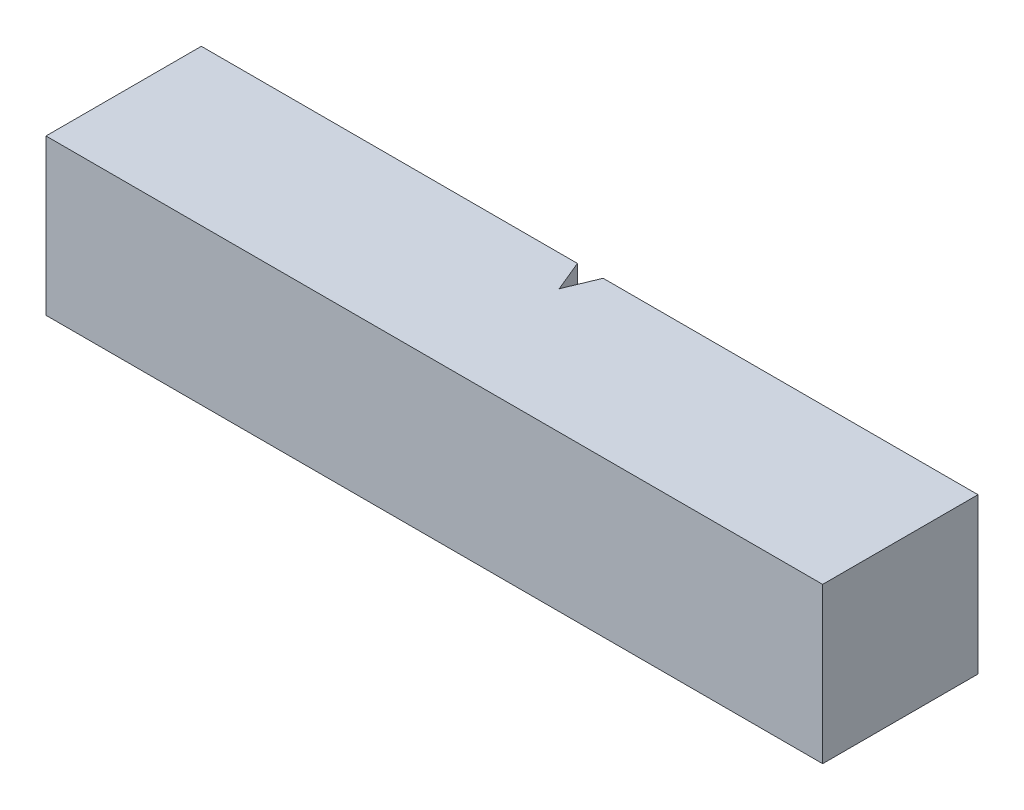
ISO-10303-21;
HEADER;
FILE_DESCRIPTION(('STEP AP214'),'2;1');
FILE_NAME('part.step','',(''),(''),'','','');
FILE_SCHEMA(('AUTOMOTIVE_DESIGN { 1 0 10303 214 1 1 1 1 }'));
ENDSEC;
DATA;
#1=APPLICATION_CONTEXT('core data for automotive mechanical design processes');
#2=APPLICATION_PROTOCOL_DEFINITION('international standard','automotive_design',2000,#1);
#3=PRODUCT_CONTEXT('',#1,'mechanical');
#4=PRODUCT('Part','Part','',(#3));
#5=PRODUCT_RELATED_PRODUCT_CATEGORY('part','',(#4));
#6=PRODUCT_DEFINITION_FORMATION('','',#4);
#7=PRODUCT_DEFINITION_CONTEXT('part definition',#1,'design');
#8=PRODUCT_DEFINITION('design','',#6,#7);
#9=PRODUCT_DEFINITION_SHAPE('','',#8);
#10=(LENGTH_UNIT() NAMED_UNIT(*) SI_UNIT(.MILLI.,.METRE.));
#11=(NAMED_UNIT(*) PLANE_ANGLE_UNIT() SI_UNIT($,.RADIAN.));
#12=(NAMED_UNIT(*) SI_UNIT($,.STERADIAN.) SOLID_ANGLE_UNIT());
#13=UNCERTAINTY_MEASURE_WITH_UNIT(LENGTH_MEASURE(1.E-05),#10,'distance_accuracy_value','');
#14=(GEOMETRIC_REPRESENTATION_CONTEXT(3) GLOBAL_UNCERTAINTY_ASSIGNED_CONTEXT((#13)) GLOBAL_UNIT_ASSIGNED_CONTEXT((#10,
#11,#12)) REPRESENTATION_CONTEXT('',''));
#15=CARTESIAN_POINT('',(0.,0.,0.));
#16=DIRECTION('',(0.,0.,1.));
#17=DIRECTION('',(1.,0.,0.));
#18=AXIS2_PLACEMENT_3D('',#15,#16,#17);
#19=CARTESIAN_POINT('',(0.,12.7,0.));
#20=DIRECTION('',(0.,0.,1.));
#21=DIRECTION('',(1.,0.,0.));
#22=AXIS2_PLACEMENT_3D('',#19,#20,#21);
#23=PLANE('',#22);
#24=DIRECTION('',(-1.,0.,0.));
#25=VECTOR('',#24,1.);
#26=CARTESIAN_POINT('',(0.,0.,0.));
#27=LINE('',#26,#25);
#28=CARTESIAN_POINT('',(0.,0.,0.));
#29=VERTEX_POINT('',#28);
#30=CARTESIAN_POINT('',(-63.5,0.,0.));
#31=VERTEX_POINT('',#30);
#32=EDGE_CURVE('E142',#29,#31,#27,.T.);
#33=ORIENTED_EDGE('',*,*,#32,.F.);
#34=DIRECTION('',(0.,-1.,0.));
#35=VECTOR('',#34,1.);
#36=CARTESIAN_POINT('',(0.,12.7,0.));
#37=LINE('',#36,#35);
#38=CARTESIAN_POINT('',(0.,12.7,0.));
#39=VERTEX_POINT('',#38);
#40=EDGE_CURVE('E11',#39,#29,#37,.T.);
#41=ORIENTED_EDGE('',*,*,#40,.F.);
#42=DIRECTION('',(-1.,0.,0.));
#43=VECTOR('',#42,1.);
#44=CARTESIAN_POINT('',(0.,12.7,0.));
#45=LINE('',#44,#43);
#46=CARTESIAN_POINT('',(-63.5,12.7,0.));
#47=VERTEX_POINT('',#46);
#48=EDGE_CURVE('E165',#39,#47,#45,.T.);
#49=ORIENTED_EDGE('',*,*,#48,.T.);
#50=DIRECTION('',(0.,-1.,0.));
#51=VECTOR('',#50,1.);
#52=CARTESIAN_POINT('',(-63.5,12.7,0.));
#53=LINE('',#52,#51);
#54=EDGE_CURVE('E64',#47,#31,#53,.T.);
#55=ORIENTED_EDGE('',*,*,#54,.T.);
#56=EDGE_LOOP('',(#33,#41,#49,#55));
#57=FACE_BOUND('',#56,.T.);
#58=ADVANCED_FACE('F47',(#57),#23,.T.);
#59=CARTESIAN_POINT('',(0.,12.7,0.));
#60=DIRECTION('',(-1.,0.,0.));
#61=DIRECTION('',(0.,0.,1.));
#62=AXIS2_PLACEMENT_3D('',#59,#60,#61);
#63=PLANE('',#62);
#64=DIRECTION('',(0.,0.,-1.));
#65=VECTOR('',#64,1.);
#66=CARTESIAN_POINT('',(0.,0.,0.));
#67=LINE('',#66,#65);
#68=CARTESIAN_POINT('',(0.,0.,-12.7));
#69=VERTEX_POINT('',#68);
#70=EDGE_CURVE('E145',#29,#69,#67,.T.);
#71=ORIENTED_EDGE('',*,*,#70,.T.);
#72=DIRECTION('',(0.,-1.,0.));
#73=VECTOR('',#72,1.);
#74=CARTESIAN_POINT('',(0.,12.7,-12.7));
#75=LINE('',#74,#73);
#76=CARTESIAN_POINT('',(0.,12.7,-12.7));
#77=VERTEX_POINT('',#76);
#78=EDGE_CURVE('E56',#77,#69,#75,.T.);
#79=ORIENTED_EDGE('',*,*,#78,.F.);
#80=DIRECTION('',(0.,0.,-1.));
#81=VECTOR('',#80,1.);
#82=CARTESIAN_POINT('',(0.,12.7,0.));
#83=LINE('',#82,#81);
#84=EDGE_CURVE('E267',#39,#77,#83,.T.);
#85=ORIENTED_EDGE('',*,*,#84,.F.);
#86=ORIENTED_EDGE('',*,*,#40,.T.);
#87=EDGE_LOOP('',(#71,#79,#85,#86));
#88=FACE_BOUND('',#87,.T.);
#89=ADVANCED_FACE('F196',(#88),#63,.F.);
#90=CARTESIAN_POINT('',(0.,12.7,-12.7));
#91=DIRECTION('',(0.,0.,1.));
#92=DIRECTION('',(1.,0.,0.));
#93=AXIS2_PLACEMENT_3D('',#90,#91,#92);
#94=PLANE('',#93);
#95=DIRECTION('',(-1.,0.,0.));
#96=VECTOR('',#95,1.);
#97=CARTESIAN_POINT('',(0.,0.,-12.7));
#98=LINE('',#97,#96);
#99=CARTESIAN_POINT('',(-30.6478976515724,0.,-12.7));
#100=VERTEX_POINT('',#99);
#101=EDGE_CURVE('E148',#69,#100,#98,.T.);
#102=ORIENTED_EDGE('',*,*,#101,.T.);
#103=DIRECTION('',(0.,-1.,0.));
#104=VECTOR('',#103,1.);
#105=CARTESIAN_POINT('',(-30.6478976515724,12.7,-12.7));
#106=LINE('',#105,#104);
#107=CARTESIAN_POINT('',(-30.6478976515724,12.7,-12.7));
#108=VERTEX_POINT('',#107);
#109=EDGE_CURVE('E172',#108,#100,#106,.T.);
#110=ORIENTED_EDGE('',*,*,#109,.F.);
#111=DIRECTION('',(-1.,0.,0.));
#112=VECTOR('',#111,1.);
#113=CARTESIAN_POINT('',(0.,12.7,-12.7));
#114=LINE('',#113,#112);
#115=EDGE_CURVE('E136',#77,#108,#114,.T.);
#116=ORIENTED_EDGE('',*,*,#115,.F.);
#117=ORIENTED_EDGE('',*,*,#78,.T.);
#118=EDGE_LOOP('',(#102,#110,#116,#117));
#119=FACE_BOUND('',#118,.T.);
#120=ADVANCED_FACE('F180',(#119),#94,.F.);
#121=CARTESIAN_POINT('',(-30.6497450155901,12.7,-12.6955400687338));
#122=DIRECTION('',(-0.923879532511295,0.,-0.382683432365071));
#123=DIRECTION('',(-0.382683432365071,0.,0.923879532511295));
#124=AXIS2_PLACEMENT_3D('',#121,#122,#123);
#125=PLANE('',#124);
#126=DIRECTION('',(0.382683432365071,0.,-0.923879532511295));
#127=VECTOR('',#126,1.);
#128=CARTESIAN_POINT('',(-30.6497450155901,0.,-12.6955400687338));
#129=LINE('',#128,#127);
#130=CARTESIAN_POINT('',(-31.7000001,0.,-10.16));
#131=VERTEX_POINT('',#130);
#132=EDGE_CURVE('E152',#131,#100,#129,.T.);
#133=ORIENTED_EDGE('',*,*,#132,.F.);
#134=DIRECTION('',(0.,-1.,0.));
#135=VECTOR('',#134,1.);
#136=CARTESIAN_POINT('',(-31.7000001,12.7,-10.16));
#137=LINE('',#136,#135);
#138=CARTESIAN_POINT('',(-31.7000001,12.7,-10.16));
#139=VERTEX_POINT('',#138);
#140=EDGE_CURVE('E119',#139,#131,#137,.T.);
#141=ORIENTED_EDGE('',*,*,#140,.F.);
#142=DIRECTION('',(0.382683432365071,0.,-0.923879532511295));
#143=VECTOR('',#142,1.);
#144=CARTESIAN_POINT('',(-30.6497450155901,12.7,-12.6955400687338));
#145=LINE('',#144,#143);
#146=EDGE_CURVE('E132',#139,#108,#145,.T.);
#147=ORIENTED_EDGE('',*,*,#146,.T.);
#148=ORIENTED_EDGE('',*,*,#109,.T.);
#149=EDGE_LOOP('',(#133,#141,#147,#148));
#150=FACE_BOUND('',#149,.T.);
#151=ADVANCED_FACE('F188',(#150),#125,.T.);
#152=CARTESIAN_POINT('',(-23.4655401187339,12.7,9.71974496559002));
#153=DIRECTION('',(0.92387953251128,0.,-0.382683432365105));
#154=DIRECTION('',(-0.382683432365105,0.,-0.92387953251128));
#155=AXIS2_PLACEMENT_3D('',#152,#153,#154);
#156=PLANE('',#155);
#157=DIRECTION('',(0.382683432365105,0.,0.92387953251128));
#158=VECTOR('',#157,1.);
#159=CARTESIAN_POINT('',(-23.4655401187339,0.,9.71974496559002));
#160=LINE('',#159,#158);
#161=CARTESIAN_POINT('',(-32.7521025484277,0.,-12.7));
#162=VERTEX_POINT('',#161);
#163=EDGE_CURVE('E115',#162,#131,#160,.T.);
#164=ORIENTED_EDGE('',*,*,#163,.F.);
#165=DIRECTION('',(0.,-1.,0.));
#166=VECTOR('',#165,1.);
#167=CARTESIAN_POINT('',(-32.7521025484277,12.7,-12.7));
#168=LINE('',#167,#166);
#169=CARTESIAN_POINT('',(-32.7521025484277,12.7,-12.7));
#170=VERTEX_POINT('',#169);
#171=EDGE_CURVE('E109',#170,#162,#168,.T.);
#172=ORIENTED_EDGE('',*,*,#171,.F.);
#173=DIRECTION('',(0.382683432365105,0.,0.92387953251128));
#174=VECTOR('',#173,1.);
#175=CARTESIAN_POINT('',(-23.4655401187339,12.7,9.71974496559002));
#176=LINE('',#175,#174);
#177=EDGE_CURVE('E113',#170,#139,#176,.T.);
#178=ORIENTED_EDGE('',*,*,#177,.T.);
#179=ORIENTED_EDGE('',*,*,#140,.T.);
#180=EDGE_LOOP('',(#164,#172,#178,#179));
#181=FACE_BOUND('',#180,.T.);
#182=ADVANCED_FACE('F111',(#181),#156,.T.);
#183=CARTESIAN_POINT('',(0.,12.7,-12.7));
#184=DIRECTION('',(0.,0.,1.));
#185=DIRECTION('',(1.,0.,0.));
#186=AXIS2_PLACEMENT_3D('',#183,#184,#185);
#187=PLANE('',#186);
#188=DIRECTION('',(-1.,0.,0.));
#189=VECTOR('',#188,1.);
#190=CARTESIAN_POINT('',(0.,0.,-12.7));
#191=LINE('',#190,#189);
#192=CARTESIAN_POINT('',(-63.5,0.,-12.7));
#193=VERTEX_POINT('',#192);
#194=EDGE_CURVE('E158',#162,#193,#191,.T.);
#195=ORIENTED_EDGE('',*,*,#194,.T.);
#196=DIRECTION('',(0.,-1.,0.));
#197=VECTOR('',#196,1.);
#198=CARTESIAN_POINT('',(-63.5,12.7,-12.7));
#199=LINE('',#198,#197);
#200=CARTESIAN_POINT('',(-63.5,12.7,-12.7));
#201=VERTEX_POINT('',#200);
#202=EDGE_CURVE('E87',#201,#193,#199,.T.);
#203=ORIENTED_EDGE('',*,*,#202,.F.);
#204=DIRECTION('',(-1.,0.,0.));
#205=VECTOR('',#204,1.);
#206=CARTESIAN_POINT('',(0.,12.7,-12.7));
#207=LINE('',#206,#205);
#208=EDGE_CURVE('E121',#170,#201,#207,.T.);
#209=ORIENTED_EDGE('',*,*,#208,.F.);
#210=ORIENTED_EDGE('',*,*,#171,.T.);
#211=EDGE_LOOP('',(#195,#203,#209,#210));
#212=FACE_BOUND('',#211,.T.);
#213=ADVANCED_FACE('F122',(#212),#187,.F.);
#214=CARTESIAN_POINT('',(-63.5,12.7,0.));
#215=DIRECTION('',(-1.,0.,0.));
#216=DIRECTION('',(0.,0.,1.));
#217=AXIS2_PLACEMENT_3D('',#214,#215,#216);
#218=PLANE('',#217);
#219=DIRECTION('',(0.,0.,-1.));
#220=VECTOR('',#219,1.);
#221=CARTESIAN_POINT('',(-63.5,0.,0.));
#222=LINE('',#221,#220);
#223=EDGE_CURVE('E161',#31,#193,#222,.T.);
#224=ORIENTED_EDGE('',*,*,#223,.F.);
#225=ORIENTED_EDGE('',*,*,#54,.F.);
#226=DIRECTION('',(0.,0.,-1.));
#227=VECTOR('',#226,1.);
#228=CARTESIAN_POINT('',(-63.5,12.7,0.));
#229=LINE('',#228,#227);
#230=EDGE_CURVE('E126',#47,#201,#229,.T.);
#231=ORIENTED_EDGE('',*,*,#230,.T.);
#232=ORIENTED_EDGE('',*,*,#202,.T.);
#233=EDGE_LOOP('',(#224,#225,#231,#232));
#234=FACE_BOUND('',#233,.T.);
#235=ADVANCED_FACE('F202',(#234),#218,.T.);
#236=CARTESIAN_POINT('',(0.,12.7,0.));
#237=DIRECTION('',(0.,1.,0.));
#238=DIRECTION('',(0.,0.,1.));
#239=AXIS2_PLACEMENT_3D('',#236,#237,#238);
#240=PLANE('',#239);
#241=ORIENTED_EDGE('',*,*,#48,.F.);
#242=ORIENTED_EDGE('',*,*,#84,.T.);
#243=ORIENTED_EDGE('',*,*,#115,.T.);
#244=ORIENTED_EDGE('',*,*,#146,.F.);
#245=ORIENTED_EDGE('',*,*,#177,.F.);
#246=ORIENTED_EDGE('',*,*,#208,.T.);
#247=ORIENTED_EDGE('',*,*,#230,.F.);
#248=EDGE_LOOP('',(#241,#242,#243,#244,#245,#246,#247));
#249=FACE_BOUND('',#248,.T.);
#250=ADVANCED_FACE('F130',(#249),#240,.T.);
#251=CARTESIAN_POINT('',(0.,0.,0.));
#252=DIRECTION('',(0.,1.,0.));
#253=DIRECTION('',(0.,0.,1.));
#254=AXIS2_PLACEMENT_3D('',#251,#252,#253);
#255=PLANE('',#254);
#256=ORIENTED_EDGE('',*,*,#32,.T.);
#257=ORIENTED_EDGE('',*,*,#223,.T.);
#258=ORIENTED_EDGE('',*,*,#194,.F.);
#259=ORIENTED_EDGE('',*,*,#163,.T.);
#260=ORIENTED_EDGE('',*,*,#132,.T.);
#261=ORIENTED_EDGE('',*,*,#101,.F.);
#262=ORIENTED_EDGE('',*,*,#70,.F.);
#263=EDGE_LOOP('',(#256,#257,#258,#259,#260,#261,#262));
#264=FACE_BOUND('',#263,.T.);
#265=ADVANCED_FACE('F185',(#264),#255,.F.);
#266=CLOSED_SHELL('',(#58,#89,#120,#151,#182,#213,#235,#250,#265));
#267=MANIFOLD_SOLID_BREP('B2',#266);
#268=ADVANCED_BREP_SHAPE_REPRESENTATION('',(#18,#267),#14);
#269=SHAPE_DEFINITION_REPRESENTATION(#9,#268);
ENDSEC;
END-ISO-10303-21;
